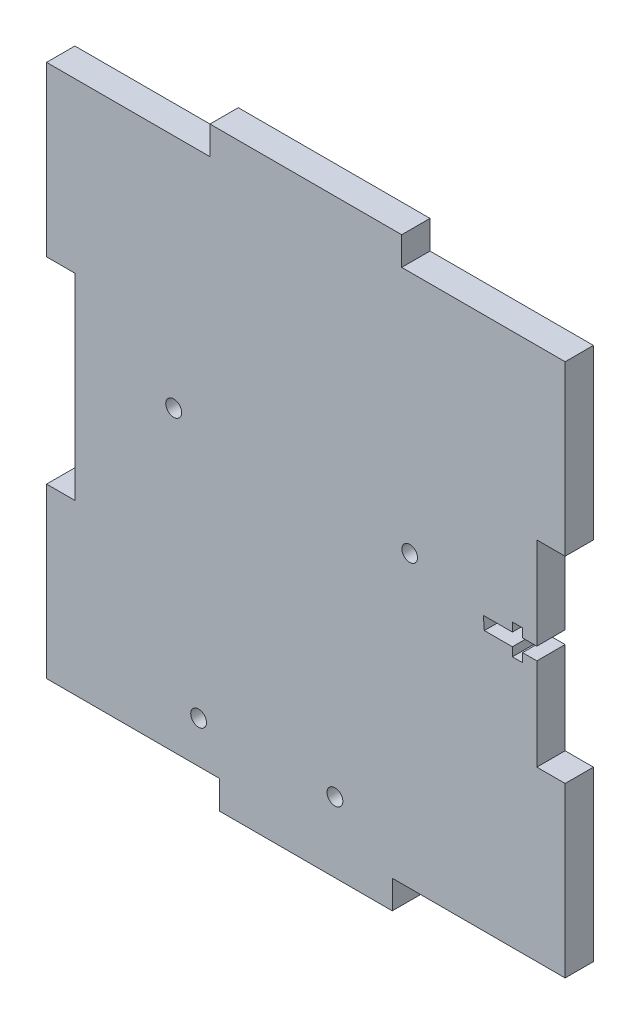
ISO-10303-21;
HEADER;
FILE_DESCRIPTION(('STEP AP214'),'2;1');
FILE_NAME('part.step','',(''),(''),'','','');
FILE_SCHEMA(('AUTOMOTIVE_DESIGN { 1 0 10303 214 1 1 1 1 }'));
ENDSEC;
DATA;
#1=APPLICATION_CONTEXT('core data for automotive mechanical design processes');
#2=APPLICATION_PROTOCOL_DEFINITION('international standard','automotive_design',2000,#1);
#3=PRODUCT_CONTEXT('',#1,'mechanical');
#4=PRODUCT('Part','Part','',(#3));
#5=PRODUCT_RELATED_PRODUCT_CATEGORY('part','',(#4));
#6=PRODUCT_DEFINITION_FORMATION('','',#4);
#7=PRODUCT_DEFINITION_CONTEXT('part definition',#1,'design');
#8=PRODUCT_DEFINITION('design','',#6,#7);
#9=PRODUCT_DEFINITION_SHAPE('','',#8);
#10=(LENGTH_UNIT() NAMED_UNIT(*) SI_UNIT(.MILLI.,.METRE.));
#11=(NAMED_UNIT(*) PLANE_ANGLE_UNIT() SI_UNIT($,.RADIAN.));
#12=(NAMED_UNIT(*) SI_UNIT($,.STERADIAN.) SOLID_ANGLE_UNIT());
#13=UNCERTAINTY_MEASURE_WITH_UNIT(LENGTH_MEASURE(1.E-05),#10,'distance_accuracy_value','');
#14=(GEOMETRIC_REPRESENTATION_CONTEXT(3) GLOBAL_UNCERTAINTY_ASSIGNED_CONTEXT((#13)) GLOBAL_UNIT_ASSIGNED_CONTEXT((#10,
#11,#12)) REPRESENTATION_CONTEXT('',''));
#15=CARTESIAN_POINT('',(0.,0.,0.));
#16=DIRECTION('',(0.,0.,1.));
#17=DIRECTION('',(1.,0.,0.));
#18=AXIS2_PLACEMENT_3D('',#15,#16,#17);
#19=CARTESIAN_POINT('',(-53.0606,-60.4012,5.7912));
#20=DIRECTION('',(1.,0.,0.));
#21=DIRECTION('',(0.,0.,-1.));
#22=AXIS2_PLACEMENT_3D('',#19,#20,#21);
#23=PLANE('',#22);
#24=DIRECTION('',(0.,-1.,0.));
#25=VECTOR('',#24,1.);
#26=CARTESIAN_POINT('',(-53.0606,-60.4012,5.7912));
#27=LINE('',#26,#25);
#28=CARTESIAN_POINT('',(-53.0606,-20.1337333333333,5.79120000000005));
#29=VERTEX_POINT('',#28);
#30=CARTESIAN_POINT('',(-53.0605999999982,-54.61,5.7912));
#31=VERTEX_POINT('',#30);
#32=EDGE_CURVE('E269',#29,#31,#27,.T.);
#33=ORIENTED_EDGE('',*,*,#32,.F.);
#34=DIRECTION('',(0.,0.,-1.));
#35=VECTOR('',#34,1.);
#36=CARTESIAN_POINT('',(-53.0606,-20.1337333333333,5.79120000000005));
#37=LINE('',#36,#35);
#38=CARTESIAN_POINT('',(-53.0606,-20.1337333333333,0.));
#39=VERTEX_POINT('',#38);
#40=EDGE_CURVE('E519',#29,#39,#37,.T.);
#41=ORIENTED_EDGE('',*,*,#40,.T.);
#42=DIRECTION('',(0.,-1.,0.));
#43=VECTOR('',#42,1.);
#44=CARTESIAN_POINT('',(-53.0606,-60.4012,0.));
#45=LINE('',#44,#43);
#46=CARTESIAN_POINT('',(-53.0605999999982,-54.61,0.));
#47=VERTEX_POINT('',#46);
#48=EDGE_CURVE('E285',#39,#47,#45,.T.);
#49=ORIENTED_EDGE('',*,*,#48,.T.);
#50=DIRECTION('',(0.,0.,1.));
#51=VECTOR('',#50,1.);
#52=CARTESIAN_POINT('',(-53.0605999999982,-54.61,0.));
#53=LINE('',#52,#51);
#54=EDGE_CURVE('E398',#47,#31,#53,.T.);
#55=ORIENTED_EDGE('',*,*,#54,.T.);
#56=EDGE_LOOP('',(#33,#41,#49,#55));
#57=FACE_BOUND('',#56,.T.);
#58=ADVANCED_FACE('F35',(#57),#23,.F.);
#59=CARTESIAN_POINT('',(53.0606,-60.4012,5.7912));
#60=DIRECTION('',(-1.,0.,0.));
#61=DIRECTION('',(0.,0.,1.));
#62=AXIS2_PLACEMENT_3D('',#59,#60,#61);
#63=PLANE('',#62);
#64=DIRECTION('',(0.,1.,0.));
#65=VECTOR('',#64,1.);
#66=CARTESIAN_POINT('',(53.0606,-60.4012,5.7912));
#67=LINE('',#66,#65);
#68=CARTESIAN_POINT('',(53.0606,20.1337333333333,5.79120000000005));
#69=VERTEX_POINT('',#68);
#70=CARTESIAN_POINT('',(53.0606,54.61,5.79120000000005));
#71=VERTEX_POINT('',#70);
#72=EDGE_CURVE('E290',#69,#71,#67,.T.);
#73=ORIENTED_EDGE('',*,*,#72,.F.);
#74=DIRECTION('',(0.,0.,-1.));
#75=VECTOR('',#74,1.);
#76=CARTESIAN_POINT('',(53.0606,20.1337333333333,5.79120000000005));
#77=LINE('',#76,#75);
#78=CARTESIAN_POINT('',(53.0606,20.1337333333333,0.));
#79=VERTEX_POINT('',#78);
#80=EDGE_CURVE('E427',#69,#79,#77,.T.);
#81=ORIENTED_EDGE('',*,*,#80,.T.);
#82=DIRECTION('',(0.,1.,0.));
#83=VECTOR('',#82,1.);
#84=CARTESIAN_POINT('',(53.0606,-60.4012,0.));
#85=LINE('',#84,#83);
#86=CARTESIAN_POINT('',(53.0606,54.61,0.));
#87=VERTEX_POINT('',#86);
#88=EDGE_CURVE('E282',#79,#87,#85,.T.);
#89=ORIENTED_EDGE('',*,*,#88,.T.);
#90=DIRECTION('',(0.,0.,-1.));
#91=VECTOR('',#90,1.);
#92=CARTESIAN_POINT('',(53.0606,54.61,5.79120000000005));
#93=LINE('',#92,#91);
#94=EDGE_CURVE('E363',#71,#87,#93,.T.);
#95=ORIENTED_EDGE('',*,*,#94,.F.);
#96=EDGE_LOOP('',(#73,#81,#89,#95));
#97=FACE_BOUND('',#96,.T.);
#98=ADVANCED_FACE('F425',(#97),#63,.F.);
#99=CARTESIAN_POINT('',(42.2656,3.0861,5.79120000000005));
#100=DIRECTION('',(-1.,0.,0.));
#101=DIRECTION('',(0.,0.,1.));
#102=AXIS2_PLACEMENT_3D('',#99,#100,#101);
#103=PLANE('',#102);
#104=DIRECTION('',(0.,1.,0.));
#105=VECTOR('',#104,1.);
#106=CARTESIAN_POINT('',(42.2656,3.0861,5.79120000000005));
#107=LINE('',#106,#105);
#108=CARTESIAN_POINT('',(42.2656,1.29723700939415,5.79120000000005));
#109=VERTEX_POINT('',#108);
#110=CARTESIAN_POINT('',(42.2656,3.0861,5.79120000000005));
#111=VERTEX_POINT('',#110);
#112=EDGE_CURVE('E331',#109,#111,#107,.T.);
#113=ORIENTED_EDGE('',*,*,#112,.F.);
#114=DIRECTION('',(0.,0.,-1.));
#115=VECTOR('',#114,1.);
#116=CARTESIAN_POINT('',(42.2656,1.29723700939415,5.79120000000005));
#117=LINE('',#116,#115);
#118=CARTESIAN_POINT('',(42.2656,1.29723700939415,0.));
#119=VERTEX_POINT('',#118);
#120=EDGE_CURVE('E489',#109,#119,#117,.T.);
#121=ORIENTED_EDGE('',*,*,#120,.T.);
#122=DIRECTION('',(0.,1.,0.));
#123=VECTOR('',#122,1.);
#124=CARTESIAN_POINT('',(42.2656,3.0861,0.));
#125=LINE('',#124,#123);
#126=CARTESIAN_POINT('',(42.2656,3.0861,0.));
#127=VERTEX_POINT('',#126);
#128=EDGE_CURVE('E323',#119,#127,#125,.T.);
#129=ORIENTED_EDGE('',*,*,#128,.T.);
#130=DIRECTION('',(0.,0.,-1.));
#131=VECTOR('',#130,1.);
#132=CARTESIAN_POINT('',(42.2656,3.0861,5.79120000000005));
#133=LINE('',#132,#131);
#134=EDGE_CURVE('E314',#111,#127,#133,.T.);
#135=ORIENTED_EDGE('',*,*,#134,.F.);
#136=EDGE_LOOP('',(#113,#121,#129,#135));
#137=FACE_BOUND('',#136,.T.);
#138=ADVANCED_FACE('F499',(#137),#103,.F.);
#139=CARTESIAN_POINT('',(44.3484,3.0861,5.79120000000005));
#140=DIRECTION('',(1.,0.,0.));
#141=DIRECTION('',(0.,1.,0.));
#142=AXIS2_PLACEMENT_3D('',#139,#140,#141);
#143=PLANE('',#142);
#144=DIRECTION('',(0.,-1.,0.));
#145=VECTOR('',#144,1.);
#146=CARTESIAN_POINT('',(44.3484,3.0861,0.));
#147=LINE('',#146,#145);
#148=CARTESIAN_POINT('',(44.3484,3.0861,0.));
#149=VERTEX_POINT('',#148);
#150=CARTESIAN_POINT('',(44.3484,1.29843851988012,0.));
#151=VERTEX_POINT('',#150);
#152=EDGE_CURVE('E300',#149,#151,#147,.T.);
#153=ORIENTED_EDGE('',*,*,#152,.T.);
#154=DIRECTION('',(0.,0.,1.));
#155=VECTOR('',#154,1.);
#156=CARTESIAN_POINT('',(44.3484,1.29843851988012,5.79120000000005));
#157=LINE('',#156,#155);
#158=CARTESIAN_POINT('',(44.3484,1.29843851988012,5.79120000000005));
#159=VERTEX_POINT('',#158);
#160=EDGE_CURVE('E43',#151,#159,#157,.T.);
#161=ORIENTED_EDGE('',*,*,#160,.T.);
#162=DIRECTION('',(0.,-1.,0.));
#163=VECTOR('',#162,1.);
#164=CARTESIAN_POINT('',(44.3484,3.0861,5.79120000000005));
#165=LINE('',#164,#163);
#166=CARTESIAN_POINT('',(44.3484,3.0861,5.7912));
#167=VERTEX_POINT('',#166);
#168=EDGE_CURVE('E297',#167,#159,#165,.T.);
#169=ORIENTED_EDGE('',*,*,#168,.F.);
#170=DIRECTION('',(0.,0.,-1.));
#171=VECTOR('',#170,1.);
#172=CARTESIAN_POINT('',(44.3484,3.0861,5.79120000000005));
#173=LINE('',#172,#171);
#174=EDGE_CURVE('E338',#167,#149,#173,.T.);
#175=ORIENTED_EDGE('',*,*,#174,.T.);
#176=EDGE_LOOP('',(#153,#161,#169,#175));
#177=FACE_BOUND('',#176,.T.);
#178=ADVANCED_FACE('F296',(#177),#143,.F.);
#179=CARTESIAN_POINT('',(53.0606000000018,-54.6099999999999,0.));
#180=VERTEX_POINT('',#179);
#181=CARTESIAN_POINT('',(53.0606,-20.1337333333333,0.));
#182=VERTEX_POINT('',#181);
#183=EDGE_CURVE('E278',#180,#182,#85,.T.);
#184=ORIENTED_EDGE('',*,*,#183,.T.);
#185=DIRECTION('',(0.,0.,-1.));
#186=VECTOR('',#185,1.);
#187=CARTESIAN_POINT('',(53.0606,-20.1337333333333,5.79120000000005));
#188=LINE('',#187,#186);
#189=CARTESIAN_POINT('',(53.0606,-20.1337333333333,5.79120000000005));
#190=VERTEX_POINT('',#189);
#191=EDGE_CURVE('E450',#190,#182,#188,.T.);
#192=ORIENTED_EDGE('',*,*,#191,.F.);
#193=CARTESIAN_POINT('',(53.0606000000018,-54.6099999999999,5.79120000000005));
#194=VERTEX_POINT('',#193);
#195=EDGE_CURVE('E407',#194,#190,#67,.T.);
#196=ORIENTED_EDGE('',*,*,#195,.F.);
#197=DIRECTION('',(0.,0.,-1.));
#198=VECTOR('',#197,1.);
#199=CARTESIAN_POINT('',(53.0606000000018,-54.6099999999998,166.5224));
#200=LINE('',#199,#198);
#201=EDGE_CURVE('E401',#194,#180,#200,.T.);
#202=ORIENTED_EDGE('',*,*,#201,.T.);
#203=EDGE_LOOP('',(#184,#192,#196,#202));
#204=FACE_BOUND('',#203,.T.);
#205=ADVANCED_FACE('F37',(#204),#63,.F.);
#206=CARTESIAN_POINT('',(-53.0606,54.61,0.));
#207=VERTEX_POINT('',#206);
#208=CARTESIAN_POINT('',(-53.0606,20.1337333333333,0.));
#209=VERTEX_POINT('',#208);
#210=EDGE_CURVE('E260',#207,#209,#45,.T.);
#211=ORIENTED_EDGE('',*,*,#210,.T.);
#212=DIRECTION('',(0.,0.,-1.));
#213=VECTOR('',#212,1.);
#214=CARTESIAN_POINT('',(-53.0606,20.1337333333333,5.79120000000005));
#215=LINE('',#214,#213);
#216=CARTESIAN_POINT('',(-53.0606,20.1337333333333,5.79120000000005));
#217=VERTEX_POINT('',#216);
#218=EDGE_CURVE('E50',#217,#209,#215,.T.);
#219=ORIENTED_EDGE('',*,*,#218,.F.);
#220=CARTESIAN_POINT('',(-53.0606,54.61,5.79120000000005));
#221=VERTEX_POINT('',#220);
#222=EDGE_CURVE('E258',#221,#217,#27,.T.);
#223=ORIENTED_EDGE('',*,*,#222,.F.);
#224=DIRECTION('',(0.,0.,-1.));
#225=VECTOR('',#224,1.);
#226=CARTESIAN_POINT('',(-53.0606,54.61,5.79120000000005));
#227=LINE('',#226,#225);
#228=EDGE_CURVE('E350',#221,#207,#227,.T.);
#229=ORIENTED_EDGE('',*,*,#228,.T.);
#230=EDGE_LOOP('',(#211,#219,#223,#229));
#231=FACE_BOUND('',#230,.T.);
#232=ADVANCED_FACE('F256',(#231),#23,.F.);
#233=CARTESIAN_POINT('',(-53.0606,-60.4012,5.7912));
#234=DIRECTION('',(0.,1.,0.));
#235=DIRECTION('',(0.,0.,1.));
#236=AXIS2_PLACEMENT_3D('',#233,#234,#235);
#237=PLANE('',#236);
#238=DIRECTION('',(0.,0.,-1.));
#239=VECTOR('',#238,1.);
#240=CARTESIAN_POINT('',(17.6868666666685,-60.4011999999999,0.));
#241=LINE('',#240,#239);
#242=CARTESIAN_POINT('',(17.6868666666685,-60.4011999999999,5.79119999999993));
#243=VERTEX_POINT('',#242);
#244=CARTESIAN_POINT('',(17.6868666666685,-60.4012,0.));
#245=VERTEX_POINT('',#244);
#246=EDGE_CURVE('E375',#243,#245,#241,.T.);
#247=ORIENTED_EDGE('',*,*,#246,.F.);
#248=DIRECTION('',(1.,0.,0.));
#249=VECTOR('',#248,1.);
#250=CARTESIAN_POINT('',(-53.0606,-60.4012,5.7912));
#251=LINE('',#250,#249);
#252=CARTESIAN_POINT('',(-17.6868666666649,-60.4011999999999,5.79119999999994));
#253=VERTEX_POINT('',#252);
#254=EDGE_CURVE('E268',#253,#243,#251,.T.);
#255=ORIENTED_EDGE('',*,*,#254,.F.);
#256=DIRECTION('',(0.,0.,1.));
#257=VECTOR('',#256,1.);
#258=CARTESIAN_POINT('',(-17.6868666666649,-60.4011999999999,0.));
#259=LINE('',#258,#257);
#260=CARTESIAN_POINT('',(-17.6868666666649,-60.4011999999999,0.));
#261=VERTEX_POINT('',#260);
#262=EDGE_CURVE('E377',#261,#253,#259,.T.);
#263=ORIENTED_EDGE('',*,*,#262,.F.);
#264=DIRECTION('',(1.,0.,0.));
#265=VECTOR('',#264,1.);
#266=CARTESIAN_POINT('',(-53.0606,-60.4012,0.));
#267=LINE('',#266,#265);
#268=EDGE_CURVE('E287',#261,#245,#267,.T.);
#269=ORIENTED_EDGE('',*,*,#268,.T.);
#270=EDGE_LOOP('',(#247,#255,#263,#269));
#271=FACE_BOUND('',#270,.T.);
#272=ADVANCED_FACE('F442',(#271),#237,.F.);
#273=CARTESIAN_POINT('',(0.,0.,5.7912));
#274=DIRECTION('',(0.,0.,-1.));
#275=DIRECTION('',(-1.,0.,0.));
#276=AXIS2_PLACEMENT_3D('',#273,#274,#275);
#277=PLANE('',#276);
#278=CARTESIAN_POINT('',(21.254400000001,4.74000000000046,5.7912));
#279=DIRECTION('',(0.,0.,1.));
#280=DIRECTION('',(1.,0.,0.));
#281=AXIS2_PLACEMENT_3D('',#278,#279,#280);
#282=CIRCLE('',#281,1.59999999999999);
#283=CARTESIAN_POINT('',(22.854400000001,4.74000000000046,5.7912));
#284=VERTEX_POINT('',#283);
#285=EDGE_CURVE('E710',#284,#284,#282,.T.);
#286=ORIENTED_EDGE('',*,*,#285,.F.);
#287=EDGE_LOOP('',(#286));
#288=FACE_BOUND('',#287,.T.);
#289=CARTESIAN_POINT('',(-21.9455999999989,-46.0599999999996,5.7912));
#290=DIRECTION('',(0.,0.,1.));
#291=DIRECTION('',(1.,0.,0.));
#292=AXIS2_PLACEMENT_3D('',#289,#290,#291);
#293=CIRCLE('',#292,1.61295728551822);
#294=CARTESIAN_POINT('',(-20.3326427144807,-46.0599999999996,5.7912));
#295=VERTEX_POINT('',#294);
#296=EDGE_CURVE('E705',#295,#295,#293,.T.);
#297=ORIENTED_EDGE('',*,*,#296,.F.);
#298=EDGE_LOOP('',(#297));
#299=FACE_BOUND('',#298,.T.);
#300=CARTESIAN_POINT('',(-27.0455999999989,6.34000000000041,5.7912));
#301=DIRECTION('',(0.,0.,1.));
#302=DIRECTION('',(1.,0.,0.));
#303=AXIS2_PLACEMENT_3D('',#300,#301,#302);
#304=CIRCLE('',#303,1.62888144865758);
#305=CARTESIAN_POINT('',(-25.4167185513414,6.34000000000041,5.7912));
#306=VERTEX_POINT('',#305);
#307=EDGE_CURVE('E641',#306,#306,#304,.T.);
#308=ORIENTED_EDGE('',*,*,#307,.F.);
#309=EDGE_LOOP('',(#308));
#310=FACE_BOUND('',#309,.T.);
#311=CARTESIAN_POINT('',(5.95440000000109,-46.0599999999995,5.7912));
#312=DIRECTION('',(0.,0.,1.));
#313=DIRECTION('',(1.,0.,0.));
#314=AXIS2_PLACEMENT_3D('',#311,#312,#313);
#315=CIRCLE('',#314,1.61582846667146);
#316=CARTESIAN_POINT('',(7.57022846667256,-46.0599999999995,5.7912));
#317=VERTEX_POINT('',#316);
#318=EDGE_CURVE('E634',#317,#317,#315,.T.);
#319=ORIENTED_EDGE('',*,*,#318,.F.);
#320=EDGE_LOOP('',(#319));
#321=FACE_BOUND('',#320,.T.);
#322=DIRECTION('',(0.,-1.,0.));
#323=VECTOR('',#322,1.);
#324=CARTESIAN_POINT('',(-47.2694,-20.1337333333333,5.79120000000005));
#325=LINE('',#324,#323);
#326=CARTESIAN_POINT('',(-47.2694,20.1337333333333,5.79120000000005));
#327=VERTEX_POINT('',#326);
#328=CARTESIAN_POINT('',(-47.2694,-20.1337333333333,5.79120000000005));
#329=VERTEX_POINT('',#328);
#330=EDGE_CURVE('E250',#327,#329,#325,.T.);
#331=ORIENTED_EDGE('',*,*,#330,.T.);
#332=DIRECTION('',(-1.,0.,0.));
#333=VECTOR('',#332,1.);
#334=CARTESIAN_POINT('',(-53.0606,-20.1337333333333,5.79120000000005));
#335=LINE('',#334,#333);
#336=EDGE_CURVE('E261',#329,#29,#335,.T.);
#337=ORIENTED_EDGE('',*,*,#336,.T.);
#338=ORIENTED_EDGE('',*,*,#32,.T.);
#339=DIRECTION('',(-1.,0.,0.));
#340=VECTOR('',#339,1.);
#341=CARTESIAN_POINT('',(0.,-54.6099999999999,5.7912));
#342=LINE('',#341,#340);
#343=CARTESIAN_POINT('',(-17.6868666666649,-54.6099999999999,5.79119999999994));
#344=VERTEX_POINT('',#343);
#345=EDGE_CURVE('E404',#344,#31,#342,.T.);
#346=ORIENTED_EDGE('',*,*,#345,.F.);
#347=DIRECTION('',(0.,1.,0.));
#348=VECTOR('',#347,1.);
#349=CARTESIAN_POINT('',(-17.6868666666649,-60.4011999999999,5.79119999999994));
#350=LINE('',#349,#348);
#351=EDGE_CURVE('E388',#253,#344,#350,.T.);
#352=ORIENTED_EDGE('',*,*,#351,.F.);
#353=ORIENTED_EDGE('',*,*,#254,.T.);
#354=DIRECTION('',(0.,1.,0.));
#355=VECTOR('',#354,1.);
#356=CARTESIAN_POINT('',(17.6868666666685,-60.4011999999999,5.79119999999993));
#357=LINE('',#356,#355);
#358=CARTESIAN_POINT('',(17.6868666666684,-54.6099999999999,5.79119999999993));
#359=VERTEX_POINT('',#358);
#360=EDGE_CURVE('E384',#243,#359,#357,.T.);
#361=ORIENTED_EDGE('',*,*,#360,.T.);
#362=EDGE_CURVE('E406',#194,#359,#342,.T.);
#363=ORIENTED_EDGE('',*,*,#362,.F.);
#364=ORIENTED_EDGE('',*,*,#195,.T.);
#365=DIRECTION('',(-1.,0.,0.));
#366=VECTOR('',#365,1.);
#367=CARTESIAN_POINT('',(53.0606,-20.1337333333333,5.79120000000005));
#368=LINE('',#367,#366);
#369=CARTESIAN_POINT('',(47.2694,-20.1337333333333,5.79120000000005));
#370=VERTEX_POINT('',#369);
#371=EDGE_CURVE('E511',#190,#370,#368,.T.);
#372=ORIENTED_EDGE('',*,*,#371,.T.);
#373=DIRECTION('',(0.,1.,0.));
#374=VECTOR('',#373,1.);
#375=CARTESIAN_POINT('',(47.2694,-20.1337333333333,5.79120000000005));
#376=LINE('',#375,#374);
#377=CARTESIAN_POINT('',(47.2694,-1.30175,5.79120000000005));
#378=VERTEX_POINT('',#377);
#379=EDGE_CURVE('E457',#370,#378,#376,.T.);
#380=ORIENTED_EDGE('',*,*,#379,.T.);
#381=DIRECTION('',(-1.,0.,0.));
#382=VECTOR('',#381,1.);
#383=CARTESIAN_POINT('',(50.0888,-1.30175,5.79120000000005));
#384=LINE('',#383,#382);
#385=CARTESIAN_POINT('',(44.3484,-1.30175000000001,5.79120000000005));
#386=VERTEX_POINT('',#385);
#387=EDGE_CURVE('E468',#378,#386,#384,.T.);
#388=ORIENTED_EDGE('',*,*,#387,.T.);
#389=CARTESIAN_POINT('',(44.3484,-3.0861,5.79120000000005));
#390=VERTEX_POINT('',#389);
#391=EDGE_CURVE('E311',#386,#390,#165,.T.);
#392=ORIENTED_EDGE('',*,*,#391,.T.);
#393=DIRECTION('',(-1.,0.,0.));
#394=VECTOR('',#393,1.);
#395=CARTESIAN_POINT('',(42.2656,-3.0861,5.79120000000005));
#396=LINE('',#395,#394);
#397=CARTESIAN_POINT('',(42.2656,-3.0861,5.79120000000005));
#398=VERTEX_POINT('',#397);
#399=EDGE_CURVE('E310',#390,#398,#396,.T.);
#400=ORIENTED_EDGE('',*,*,#399,.T.);
#401=CARTESIAN_POINT('',(42.2656,-1.30175000000002,5.79120000000005));
#402=VERTEX_POINT('',#401);
#403=EDGE_CURVE('E491',#398,#402,#107,.T.);
#404=ORIENTED_EDGE('',*,*,#403,.T.);
#405=CARTESIAN_POINT('',(36.5252,-1.30175000000002,5.79120000000005));
#406=VERTEX_POINT('',#405);
#407=EDGE_CURVE('E467',#402,#406,#384,.T.);
#408=ORIENTED_EDGE('',*,*,#407,.T.);
#409=DIRECTION('',(-0.0780479006445477,0.996949610163412,0.));
#410=VECTOR('',#409,1.);
#411=CARTESIAN_POINT('',(36.3220022906719,1.29380831006048,5.79120000000005));
#412=LINE('',#411,#410);
#413=CARTESIAN_POINT('',(36.3220022906719,1.29380831006048,5.79120000000005));
#414=VERTEX_POINT('',#413);
#415=EDGE_CURVE('E470',#406,#414,#412,.T.);
#416=ORIENTED_EDGE('',*,*,#415,.T.);
#417=DIRECTION('',(0.999999833608978,0.000576872616695067,0.));
#418=VECTOR('',#417,1.);
#419=CARTESIAN_POINT('',(50.0888,1.30175,5.79120000000005));
#420=LINE('',#419,#418);
#421=EDGE_CURVE('E464',#414,#109,#420,.T.);
#422=ORIENTED_EDGE('',*,*,#421,.T.);
#423=ORIENTED_EDGE('',*,*,#112,.T.);
#424=DIRECTION('',(1.,0.,0.));
#425=VECTOR('',#424,1.);
#426=CARTESIAN_POINT('',(42.2656,3.0861,5.79120000000005));
#427=LINE('',#426,#425);
#428=EDGE_CURVE('E309',#111,#167,#427,.T.);
#429=ORIENTED_EDGE('',*,*,#428,.T.);
#430=ORIENTED_EDGE('',*,*,#168,.T.);
#431=CARTESIAN_POINT('',(47.2694,1.30012356507387,5.79120000000005));
#432=VERTEX_POINT('',#431);
#433=EDGE_CURVE('E307',#159,#432,#420,.T.);
#434=ORIENTED_EDGE('',*,*,#433,.T.);
#435=CARTESIAN_POINT('',(47.2694,20.1337333333333,5.79120000000005));
#436=VERTEX_POINT('',#435);
#437=EDGE_CURVE('E510',#432,#436,#376,.T.);
#438=ORIENTED_EDGE('',*,*,#437,.T.);
#439=DIRECTION('',(1.,0.,0.));
#440=VECTOR('',#439,1.);
#441=CARTESIAN_POINT('',(53.0606,20.1337333333333,5.79120000000005));
#442=LINE('',#441,#440);
#443=EDGE_CURVE('E417',#436,#69,#442,.T.);
#444=ORIENTED_EDGE('',*,*,#443,.T.);
#445=ORIENTED_EDGE('',*,*,#72,.T.);
#446=DIRECTION('',(-1.,0.,0.));
#447=VECTOR('',#446,1.);
#448=CARTESIAN_POINT('',(53.0606,54.61,5.79120000000005));
#449=LINE('',#448,#447);
#450=CARTESIAN_POINT('',(19.6172666666667,54.61,5.79120000000005));
#451=VERTEX_POINT('',#450);
#452=EDGE_CURVE('E356',#71,#451,#449,.T.);
#453=ORIENTED_EDGE('',*,*,#452,.T.);
#454=DIRECTION('',(0.,1.,0.));
#455=VECTOR('',#454,1.);
#456=CARTESIAN_POINT('',(19.6172666666667,60.4012,5.79120000000005));
#457=LINE('',#456,#455);
#458=CARTESIAN_POINT('',(19.6172666666667,60.4012,5.79120000000005));
#459=VERTEX_POINT('',#458);
#460=EDGE_CURVE('E359',#451,#459,#457,.T.);
#461=ORIENTED_EDGE('',*,*,#460,.T.);
#462=DIRECTION('',(-1.,0.,0.));
#463=VECTOR('',#462,1.);
#464=CARTESIAN_POINT('',(-53.0606,60.4012,5.7912));
#465=LINE('',#464,#463);
#466=CARTESIAN_POINT('',(-19.6172666666667,60.4012,5.7912));
#467=VERTEX_POINT('',#466);
#468=EDGE_CURVE('E274',#459,#467,#465,.T.);
#469=ORIENTED_EDGE('',*,*,#468,.T.);
#470=DIRECTION('',(0.,-1.,0.));
#471=VECTOR('',#470,1.);
#472=CARTESIAN_POINT('',(-19.6172666666667,60.4012,5.79120000000005));
#473=LINE('',#472,#471);
#474=CARTESIAN_POINT('',(-19.6172666666667,54.61,5.79120000000005));
#475=VERTEX_POINT('',#474);
#476=EDGE_CURVE('E342',#467,#475,#473,.T.);
#477=ORIENTED_EDGE('',*,*,#476,.T.);
#478=DIRECTION('',(-1.,0.,0.));
#479=VECTOR('',#478,1.);
#480=CARTESIAN_POINT('',(-53.0606,54.61,5.79120000000005));
#481=LINE('',#480,#479);
#482=EDGE_CURVE('E267',#475,#221,#481,.T.);
#483=ORIENTED_EDGE('',*,*,#482,.T.);
#484=ORIENTED_EDGE('',*,*,#222,.T.);
#485=DIRECTION('',(1.,0.,0.));
#486=VECTOR('',#485,1.);
#487=CARTESIAN_POINT('',(-53.0606,20.1337333333333,5.79120000000005));
#488=LINE('',#487,#486);
#489=EDGE_CURVE('E243',#217,#327,#488,.T.);
#490=ORIENTED_EDGE('',*,*,#489,.T.);
#491=EDGE_LOOP('',(#331,#337,#338,#346,#352,#353,#361,#363,#364,#372,#380,#388,#392,#400,#404,
#408,#416,#422,#423,#429,#430,#434,#438,#444,#445,#453,#461,#469,#477,#483,#484,#490));
#492=FACE_BOUND('',#491,.T.);
#493=ADVANCED_FACE('F264',(#288,#299,#310,#321,#492),#277,.F.);
#494=CARTESIAN_POINT('',(0.,0.,0.));
#495=DIRECTION('',(0.,0.,-1.));
#496=DIRECTION('',(-1.,0.,0.));
#497=AXIS2_PLACEMENT_3D('',#494,#495,#496);
#498=PLANE('',#497);
#499=CARTESIAN_POINT('',(21.254400000001,4.74000000000046,0.));
#500=DIRECTION('',(0.,0.,1.));
#501=DIRECTION('',(1.,0.,0.));
#502=AXIS2_PLACEMENT_3D('',#499,#500,#501);
#503=CIRCLE('',#502,1.59999999999999);
#504=CARTESIAN_POINT('',(22.854400000001,4.74000000000046,0.));
#505=VERTEX_POINT('',#504);
#506=EDGE_CURVE('E694',#505,#505,#503,.T.);
#507=ORIENTED_EDGE('',*,*,#506,.T.);
#508=EDGE_LOOP('',(#507));
#509=FACE_BOUND('',#508,.T.);
#510=CARTESIAN_POINT('',(-21.9455999999989,-46.0599999999996,0.));
#511=DIRECTION('',(0.,0.,1.));
#512=DIRECTION('',(1.,0.,0.));
#513=AXIS2_PLACEMENT_3D('',#510,#511,#512);
#514=CIRCLE('',#513,1.61295728551822);
#515=CARTESIAN_POINT('',(-20.3326427144807,-46.0599999999996,0.));
#516=VERTEX_POINT('',#515);
#517=EDGE_CURVE('E698',#516,#516,#514,.T.);
#518=ORIENTED_EDGE('',*,*,#517,.T.);
#519=EDGE_LOOP('',(#518));
#520=FACE_BOUND('',#519,.T.);
#521=CARTESIAN_POINT('',(-27.0455999999989,6.34000000000041,0.));
#522=DIRECTION('',(0.,0.,1.));
#523=DIRECTION('',(1.,0.,0.));
#524=AXIS2_PLACEMENT_3D('',#521,#522,#523);
#525=CIRCLE('',#524,1.62888144865758);
#526=CARTESIAN_POINT('',(-25.4167185513414,6.34000000000041,0.));
#527=VERTEX_POINT('',#526);
#528=EDGE_CURVE('E636',#527,#527,#525,.T.);
#529=ORIENTED_EDGE('',*,*,#528,.T.);
#530=EDGE_LOOP('',(#529));
#531=FACE_BOUND('',#530,.T.);
#532=CARTESIAN_POINT('',(5.95440000000109,-46.0599999999995,0.));
#533=DIRECTION('',(0.,0.,1.));
#534=DIRECTION('',(1.,0.,0.));
#535=AXIS2_PLACEMENT_3D('',#532,#533,#534);
#536=CIRCLE('',#535,1.61582846667146);
#537=CARTESIAN_POINT('',(7.57022846667256,-46.0599999999995,0.));
#538=VERTEX_POINT('',#537);
#539=EDGE_CURVE('E631',#538,#538,#536,.T.);
#540=ORIENTED_EDGE('',*,*,#539,.T.);
#541=EDGE_LOOP('',(#540));
#542=FACE_BOUND('',#541,.T.);
#543=DIRECTION('',(-1.,0.,0.));
#544=VECTOR('',#543,1.);
#545=CARTESIAN_POINT('',(-53.0606,-20.1337333333333,0.));
#546=LINE('',#545,#544);
#547=CARTESIAN_POINT('',(-47.2694,-20.1337333333333,0.));
#548=VERTEX_POINT('',#547);
#549=EDGE_CURVE('E251',#548,#39,#546,.T.);
#550=ORIENTED_EDGE('',*,*,#549,.F.);
#551=DIRECTION('',(0.,-1.,0.));
#552=VECTOR('',#551,1.);
#553=CARTESIAN_POINT('',(-47.2694,-20.1337333333333,0.));
#554=LINE('',#553,#552);
#555=CARTESIAN_POINT('',(-47.2694,20.1337333333333,0.));
#556=VERTEX_POINT('',#555);
#557=EDGE_CURVE('E649',#556,#548,#554,.T.);
#558=ORIENTED_EDGE('',*,*,#557,.F.);
#559=DIRECTION('',(1.,0.,0.));
#560=VECTOR('',#559,1.);
#561=CARTESIAN_POINT('',(-53.0606,20.1337333333333,0.));
#562=LINE('',#561,#560);
#563=EDGE_CURVE('E638',#209,#556,#562,.T.);
#564=ORIENTED_EDGE('',*,*,#563,.F.);
#565=ORIENTED_EDGE('',*,*,#210,.F.);
#566=DIRECTION('',(-1.,0.,0.));
#567=VECTOR('',#566,1.);
#568=CARTESIAN_POINT('',(-53.0606,54.61,0.));
#569=LINE('',#568,#567);
#570=CARTESIAN_POINT('',(-19.6172666666667,54.61,0.));
#571=VERTEX_POINT('',#570);
#572=EDGE_CURVE('E344',#571,#207,#569,.T.);
#573=ORIENTED_EDGE('',*,*,#572,.F.);
#574=DIRECTION('',(0.,-1.,0.));
#575=VECTOR('',#574,1.);
#576=CARTESIAN_POINT('',(-19.6172666666667,60.4012,0.));
#577=LINE('',#576,#575);
#578=CARTESIAN_POINT('',(-19.6172666666667,60.4012,0.));
#579=VERTEX_POINT('',#578);
#580=EDGE_CURVE('E334',#579,#571,#577,.T.);
#581=ORIENTED_EDGE('',*,*,#580,.F.);
#582=DIRECTION('',(-1.,0.,0.));
#583=VECTOR('',#582,1.);
#584=CARTESIAN_POINT('',(-53.0606,60.4012,0.));
#585=LINE('',#584,#583);
#586=CARTESIAN_POINT('',(19.6172666666667,60.4012,0.));
#587=VERTEX_POINT('',#586);
#588=EDGE_CURVE('E281',#587,#579,#585,.T.);
#589=ORIENTED_EDGE('',*,*,#588,.F.);
#590=DIRECTION('',(0.,1.,0.));
#591=VECTOR('',#590,1.);
#592=CARTESIAN_POINT('',(19.6172666666667,60.4012,0.));
#593=LINE('',#592,#591);
#594=CARTESIAN_POINT('',(19.6172666666667,54.61,0.));
#595=VERTEX_POINT('',#594);
#596=EDGE_CURVE('E360',#595,#587,#593,.T.);
#597=ORIENTED_EDGE('',*,*,#596,.F.);
#598=DIRECTION('',(-1.,0.,0.));
#599=VECTOR('',#598,1.);
#600=CARTESIAN_POINT('',(53.0606,54.61,0.));
#601=LINE('',#600,#599);
#602=EDGE_CURVE('E352',#87,#595,#601,.T.);
#603=ORIENTED_EDGE('',*,*,#602,.F.);
#604=ORIENTED_EDGE('',*,*,#88,.F.);
#605=DIRECTION('',(1.,0.,0.));
#606=VECTOR('',#605,1.);
#607=CARTESIAN_POINT('',(53.0606,20.1337333333333,0.));
#608=LINE('',#607,#606);
#609=CARTESIAN_POINT('',(47.2694,20.1337333333333,0.));
#610=VERTEX_POINT('',#609);
#611=EDGE_CURVE('E514',#610,#79,#608,.T.);
#612=ORIENTED_EDGE('',*,*,#611,.F.);
#613=DIRECTION('',(0.,1.,0.));
#614=VECTOR('',#613,1.);
#615=CARTESIAN_POINT('',(47.2694,-20.1337333333333,0.));
#616=LINE('',#615,#614);
#617=CARTESIAN_POINT('',(47.2694,1.30012356507387,0.));
#618=VERTEX_POINT('',#617);
#619=EDGE_CURVE('E505',#618,#610,#616,.T.);
#620=ORIENTED_EDGE('',*,*,#619,.F.);
#621=DIRECTION('',(0.999999833608978,0.000576872616695067,0.));
#622=VECTOR('',#621,1.);
#623=CARTESIAN_POINT('',(50.0888,1.30175,0.));
#624=LINE('',#623,#622);
#625=EDGE_CURVE('E463',#151,#618,#624,.T.);
#626=ORIENTED_EDGE('',*,*,#625,.F.);
#627=ORIENTED_EDGE('',*,*,#152,.F.);
#628=DIRECTION('',(1.,0.,0.));
#629=VECTOR('',#628,1.);
#630=CARTESIAN_POINT('',(42.2656,3.0861,0.));
#631=LINE('',#630,#629);
#632=EDGE_CURVE('E322',#127,#149,#631,.T.);
#633=ORIENTED_EDGE('',*,*,#632,.F.);
#634=ORIENTED_EDGE('',*,*,#128,.F.);
#635=CARTESIAN_POINT('',(36.3220022906719,1.29380831006048,0.));
#636=VERTEX_POINT('',#635);
#637=EDGE_CURVE('E474',#636,#119,#624,.T.);
#638=ORIENTED_EDGE('',*,*,#637,.F.);
#639=DIRECTION('',(-0.0780479006445477,0.996949610163412,0.));
#640=VECTOR('',#639,1.);
#641=CARTESIAN_POINT('',(36.3220022906719,1.29380831006048,0.));
#642=LINE('',#641,#640);
#643=CARTESIAN_POINT('',(36.5252,-1.30175000000002,0.));
#644=VERTEX_POINT('',#643);
#645=EDGE_CURVE('E479',#644,#636,#642,.T.);
#646=ORIENTED_EDGE('',*,*,#645,.F.);
#647=DIRECTION('',(-1.,0.,0.));
#648=VECTOR('',#647,1.);
#649=CARTESIAN_POINT('',(50.0888,-1.30175,0.));
#650=LINE('',#649,#648);
#651=CARTESIAN_POINT('',(42.2656,-1.30175000000001,0.));
#652=VERTEX_POINT('',#651);
#653=EDGE_CURVE('E476',#652,#644,#650,.T.);
#654=ORIENTED_EDGE('',*,*,#653,.F.);
#655=CARTESIAN_POINT('',(42.2656,-3.0861,0.));
#656=VERTEX_POINT('',#655);
#657=EDGE_CURVE('E319',#656,#652,#125,.T.);
#658=ORIENTED_EDGE('',*,*,#657,.F.);
#659=DIRECTION('',(-1.,0.,0.));
#660=VECTOR('',#659,1.);
#661=CARTESIAN_POINT('',(42.2656,-3.0861,0.));
#662=LINE('',#661,#660);
#663=CARTESIAN_POINT('',(44.3484,-3.0861,0.));
#664=VERTEX_POINT('',#663);
#665=EDGE_CURVE('E328',#664,#656,#662,.T.);
#666=ORIENTED_EDGE('',*,*,#665,.F.);
#667=CARTESIAN_POINT('',(44.3484,-1.30175000000002,0.));
#668=VERTEX_POINT('',#667);
#669=EDGE_CURVE('E326',#668,#664,#147,.T.);
#670=ORIENTED_EDGE('',*,*,#669,.F.);
#671=CARTESIAN_POINT('',(47.2694,-1.30175,0.));
#672=VERTEX_POINT('',#671);
#673=EDGE_CURVE('E477',#672,#668,#650,.T.);
#674=ORIENTED_EDGE('',*,*,#673,.F.);
#675=CARTESIAN_POINT('',(47.2694,-20.1337333333333,0.));
#676=VERTEX_POINT('',#675);
#677=EDGE_CURVE('E58',#676,#672,#616,.T.);
#678=ORIENTED_EDGE('',*,*,#677,.F.);
#679=DIRECTION('',(-1.,0.,0.));
#680=VECTOR('',#679,1.);
#681=CARTESIAN_POINT('',(53.0606,-20.1337333333333,0.));
#682=LINE('',#681,#680);
#683=EDGE_CURVE('E517',#182,#676,#682,.T.);
#684=ORIENTED_EDGE('',*,*,#683,.F.);
#685=ORIENTED_EDGE('',*,*,#183,.F.);
#686=DIRECTION('',(-1.,0.,0.));
#687=VECTOR('',#686,1.);
#688=CARTESIAN_POINT('',(53.0606000000018,-54.6099999999999,0.));
#689=LINE('',#688,#687);
#690=CARTESIAN_POINT('',(17.6868666666684,-54.6099999999999,0.));
#691=VERTEX_POINT('',#690);
#692=EDGE_CURVE('E395',#180,#691,#689,.T.);
#693=ORIENTED_EDGE('',*,*,#692,.T.);
#694=DIRECTION('',(0.,1.,0.));
#695=VECTOR('',#694,1.);
#696=CARTESIAN_POINT('',(17.6868666666685,-60.4011999999999,0.));
#697=LINE('',#696,#695);
#698=EDGE_CURVE('E380',#245,#691,#697,.T.);
#699=ORIENTED_EDGE('',*,*,#698,.F.);
#700=ORIENTED_EDGE('',*,*,#268,.F.);
#701=DIRECTION('',(0.,1.,0.));
#702=VECTOR('',#701,1.);
#703=CARTESIAN_POINT('',(-17.6868666666649,-60.4011999999999,0.));
#704=LINE('',#703,#702);
#705=CARTESIAN_POINT('',(-17.6868666666649,-54.6099999999999,0.));
#706=VERTEX_POINT('',#705);
#707=EDGE_CURVE('E390',#261,#706,#704,.T.);
#708=ORIENTED_EDGE('',*,*,#707,.T.);
#709=EDGE_CURVE('E387',#706,#47,#689,.T.);
#710=ORIENTED_EDGE('',*,*,#709,.T.);
#711=ORIENTED_EDGE('',*,*,#48,.F.);
#712=EDGE_LOOP('',(#550,#558,#564,#565,#573,#581,#589,#597,#603,#604,#612,#620,#626,#627,#633,
#634,#638,#646,#654,#658,#666,#670,#674,#678,#684,#685,#693,#699,#700,#708,#710,#711));
#713=FACE_BOUND('',#712,.T.);
#714=ADVANCED_FACE('F445',(#509,#520,#531,#542,#713),#498,.T.);
#715=CARTESIAN_POINT('',(-53.0606,60.4012,5.7912));
#716=DIRECTION('',(0.,-1.,0.));
#717=DIRECTION('',(0.,0.,-1.));
#718=AXIS2_PLACEMENT_3D('',#715,#716,#717);
#719=PLANE('',#718);
#720=ORIENTED_EDGE('',*,*,#588,.T.);
#721=DIRECTION('',(0.,0.,-1.));
#722=VECTOR('',#721,1.);
#723=CARTESIAN_POINT('',(-19.6172666666667,60.4012,5.79120000000005));
#724=LINE('',#723,#722);
#725=EDGE_CURVE('E346',#467,#579,#724,.T.);
#726=ORIENTED_EDGE('',*,*,#725,.F.);
#727=ORIENTED_EDGE('',*,*,#468,.F.);
#728=DIRECTION('',(0.,0.,-1.));
#729=VECTOR('',#728,1.);
#730=CARTESIAN_POINT('',(19.6172666666667,60.4012,5.79120000000005));
#731=LINE('',#730,#729);
#732=EDGE_CURVE('E367',#459,#587,#731,.T.);
#733=ORIENTED_EDGE('',*,*,#732,.T.);
#734=EDGE_LOOP('',(#720,#726,#727,#733));
#735=FACE_BOUND('',#734,.T.);
#736=ADVANCED_FACE('F668',(#735),#719,.F.);
#737=CARTESIAN_POINT('',(-17.6868666666649,-60.4011999999999,0.));
#738=DIRECTION('',(-1.,0.,0.));
#739=DIRECTION('',(0.,1.,0.));
#740=AXIS2_PLACEMENT_3D('',#737,#738,#739);
#741=PLANE('',#740);
#742=DIRECTION('',(0.,0.,1.));
#743=VECTOR('',#742,1.);
#744=CARTESIAN_POINT('',(-17.6868666666649,-54.6099999999999,0.));
#745=LINE('',#744,#743);
#746=EDGE_CURVE('E378',#706,#344,#745,.T.);
#747=ORIENTED_EDGE('',*,*,#746,.F.);
#748=ORIENTED_EDGE('',*,*,#707,.F.);
#749=ORIENTED_EDGE('',*,*,#262,.T.);
#750=ORIENTED_EDGE('',*,*,#351,.T.);
#751=EDGE_LOOP('',(#747,#748,#749,#750));
#752=FACE_BOUND('',#751,.T.);
#753=ADVANCED_FACE('F666',(#752),#741,.T.);
#754=CARTESIAN_POINT('',(-11.9125999999982,-54.6099999999999,124.5362));
#755=DIRECTION('',(0.,-1.,0.));
#756=DIRECTION('',(-1.,0.,0.));
#757=AXIS2_PLACEMENT_3D('',#754,#755,#756);
#758=PLANE('',#757);
#759=ORIENTED_EDGE('',*,*,#345,.T.);
#760=ORIENTED_EDGE('',*,*,#54,.F.);
#761=ORIENTED_EDGE('',*,*,#709,.F.);
#762=ORIENTED_EDGE('',*,*,#746,.T.);
#763=EDGE_LOOP('',(#759,#760,#761,#762));
#764=FACE_BOUND('',#763,.T.);
#765=ADVANCED_FACE('F663',(#764),#758,.T.);
#766=ORIENTED_EDGE('',*,*,#362,.T.);
#767=DIRECTION('',(0.,0.,-1.));
#768=VECTOR('',#767,1.);
#769=CARTESIAN_POINT('',(17.6868666666684,-54.6099999999999,0.));
#770=LINE('',#769,#768);
#771=EDGE_CURVE('E370',#359,#691,#770,.T.);
#772=ORIENTED_EDGE('',*,*,#771,.T.);
#773=ORIENTED_EDGE('',*,*,#692,.F.);
#774=ORIENTED_EDGE('',*,*,#201,.F.);
#775=EDGE_LOOP('',(#766,#772,#773,#774));
#776=FACE_BOUND('',#775,.T.);
#777=ADVANCED_FACE('F432',(#776),#758,.T.);
#778=CARTESIAN_POINT('',(17.6868666666685,-60.4011999999999,0.));
#779=DIRECTION('',(1.,0.,0.));
#780=DIRECTION('',(0.,-1.,0.));
#781=AXIS2_PLACEMENT_3D('',#778,#779,#780);
#782=PLANE('',#781);
#783=ORIENTED_EDGE('',*,*,#771,.F.);
#784=ORIENTED_EDGE('',*,*,#360,.F.);
#785=ORIENTED_EDGE('',*,*,#246,.T.);
#786=ORIENTED_EDGE('',*,*,#698,.T.);
#787=EDGE_LOOP('',(#783,#784,#785,#786));
#788=FACE_BOUND('',#787,.T.);
#789=ADVANCED_FACE('F434',(#788),#782,.T.);
#790=CARTESIAN_POINT('',(19.6172666666667,60.4012,5.79120000000005));
#791=DIRECTION('',(-1.,0.,0.));
#792=DIRECTION('',(0.,0.,1.));
#793=AXIS2_PLACEMENT_3D('',#790,#791,#792);
#794=PLANE('',#793);
#795=ORIENTED_EDGE('',*,*,#596,.T.);
#796=ORIENTED_EDGE('',*,*,#732,.F.);
#797=ORIENTED_EDGE('',*,*,#460,.F.);
#798=DIRECTION('',(0.,0.,-1.));
#799=VECTOR('',#798,1.);
#800=CARTESIAN_POINT('',(19.6172666666667,54.61,5.79120000000005));
#801=LINE('',#800,#799);
#802=EDGE_CURVE('E371',#451,#595,#801,.T.);
#803=ORIENTED_EDGE('',*,*,#802,.T.);
#804=EDGE_LOOP('',(#795,#796,#797,#803));
#805=FACE_BOUND('',#804,.T.);
#806=ADVANCED_FACE('F681',(#805),#794,.F.);
#807=CARTESIAN_POINT('',(53.0606,54.61,5.79120000000005));
#808=DIRECTION('',(0.,-1.,0.));
#809=DIRECTION('',(0.,0.,-1.));
#810=AXIS2_PLACEMENT_3D('',#807,#808,#809);
#811=PLANE('',#810);
#812=ORIENTED_EDGE('',*,*,#602,.T.);
#813=ORIENTED_EDGE('',*,*,#802,.F.);
#814=ORIENTED_EDGE('',*,*,#452,.F.);
#815=ORIENTED_EDGE('',*,*,#94,.T.);
#816=EDGE_LOOP('',(#812,#813,#814,#815));
#817=FACE_BOUND('',#816,.T.);
#818=ADVANCED_FACE('F422',(#817),#811,.F.);
#819=CARTESIAN_POINT('',(-53.0606,54.61,5.79120000000005));
#820=DIRECTION('',(0.,-1.,0.));
#821=DIRECTION('',(1.,0.,0.));
#822=AXIS2_PLACEMENT_3D('',#819,#820,#821);
#823=PLANE('',#822);
#824=ORIENTED_EDGE('',*,*,#572,.T.);
#825=ORIENTED_EDGE('',*,*,#228,.F.);
#826=ORIENTED_EDGE('',*,*,#482,.F.);
#827=DIRECTION('',(0.,0.,-1.));
#828=VECTOR('',#827,1.);
#829=CARTESIAN_POINT('',(-19.6172666666667,54.61,5.79120000000005));
#830=LINE('',#829,#828);
#831=EDGE_CURVE('E353',#475,#571,#830,.T.);
#832=ORIENTED_EDGE('',*,*,#831,.T.);
#833=EDGE_LOOP('',(#824,#825,#826,#832));
#834=FACE_BOUND('',#833,.T.);
#835=ADVANCED_FACE('F879',(#834),#823,.F.);
#836=CARTESIAN_POINT('',(-19.6172666666667,60.4012,5.79120000000005));
#837=DIRECTION('',(1.,0.,0.));
#838=DIRECTION('',(0.,0.,-1.));
#839=AXIS2_PLACEMENT_3D('',#836,#837,#838);
#840=PLANE('',#839);
#841=ORIENTED_EDGE('',*,*,#580,.T.);
#842=ORIENTED_EDGE('',*,*,#831,.F.);
#843=ORIENTED_EDGE('',*,*,#476,.F.);
#844=ORIENTED_EDGE('',*,*,#725,.T.);
#845=EDGE_LOOP('',(#841,#842,#843,#844));
#846=FACE_BOUND('',#845,.T.);
#847=ADVANCED_FACE('F851',(#846),#840,.F.);
#848=ORIENTED_EDGE('',*,*,#657,.T.);
#849=DIRECTION('',(0.,0.,1.));
#850=VECTOR('',#849,1.);
#851=CARTESIAN_POINT('',(42.2656,-1.30175000000001,5.79120000000005));
#852=LINE('',#851,#850);
#853=EDGE_CURVE('E484',#652,#402,#852,.T.);
#854=ORIENTED_EDGE('',*,*,#853,.T.);
#855=ORIENTED_EDGE('',*,*,#403,.F.);
#856=DIRECTION('',(0.,0.,-1.));
#857=VECTOR('',#856,1.);
#858=CARTESIAN_POINT('',(42.2656,-3.0861,5.79120000000005));
#859=LINE('',#858,#857);
#860=EDGE_CURVE('E332',#398,#656,#859,.T.);
#861=ORIENTED_EDGE('',*,*,#860,.T.);
#862=EDGE_LOOP('',(#848,#854,#855,#861));
#863=FACE_BOUND('',#862,.T.);
#864=ADVANCED_FACE('F558',(#863),#103,.F.);
#865=CARTESIAN_POINT('',(42.2656,-3.0861,5.79120000000005));
#866=DIRECTION('',(0.,-1.,0.));
#867=DIRECTION('',(1.,0.,0.));
#868=AXIS2_PLACEMENT_3D('',#865,#866,#867);
#869=PLANE('',#868);
#870=ORIENTED_EDGE('',*,*,#665,.T.);
#871=ORIENTED_EDGE('',*,*,#860,.F.);
#872=ORIENTED_EDGE('',*,*,#399,.F.);
#873=DIRECTION('',(0.,0.,-1.));
#874=VECTOR('',#873,1.);
#875=CARTESIAN_POINT('',(44.3484,-3.0861,5.79120000000005));
#876=LINE('',#875,#874);
#877=EDGE_CURVE('E335',#390,#664,#876,.T.);
#878=ORIENTED_EDGE('',*,*,#877,.T.);
#879=EDGE_LOOP('',(#870,#871,#872,#878));
#880=FACE_BOUND('',#879,.T.);
#881=ADVANCED_FACE('F562',(#880),#869,.F.);
#882=ORIENTED_EDGE('',*,*,#391,.F.);
#883=DIRECTION('',(0.,0.,-1.));
#884=VECTOR('',#883,1.);
#885=CARTESIAN_POINT('',(44.3484,-1.30175000000001,5.79120000000005));
#886=LINE('',#885,#884);
#887=EDGE_CURVE('E272',#386,#668,#886,.T.);
#888=ORIENTED_EDGE('',*,*,#887,.T.);
#889=ORIENTED_EDGE('',*,*,#669,.T.);
#890=ORIENTED_EDGE('',*,*,#877,.F.);
#891=EDGE_LOOP('',(#882,#888,#889,#890));
#892=FACE_BOUND('',#891,.T.);
#893=ADVANCED_FACE('F553',(#892),#143,.F.);
#894=CARTESIAN_POINT('',(42.2656,3.0861,5.79120000000005));
#895=DIRECTION('',(0.,1.,0.));
#896=DIRECTION('',(0.,0.,1.));
#897=AXIS2_PLACEMENT_3D('',#894,#895,#896);
#898=PLANE('',#897);
#899=ORIENTED_EDGE('',*,*,#632,.T.);
#900=ORIENTED_EDGE('',*,*,#174,.F.);
#901=ORIENTED_EDGE('',*,*,#428,.F.);
#902=ORIENTED_EDGE('',*,*,#134,.T.);
#903=EDGE_LOOP('',(#899,#900,#901,#902));
#904=FACE_BOUND('',#903,.T.);
#905=ADVANCED_FACE('F503',(#904),#898,.F.);
#906=CARTESIAN_POINT('',(50.0888,-1.30175,5.79120000000005));
#907=DIRECTION('',(0.,-1.,0.));
#908=DIRECTION('',(1.,0.,0.));
#909=AXIS2_PLACEMENT_3D('',#906,#907,#908);
#910=PLANE('',#909);
#911=ORIENTED_EDGE('',*,*,#387,.F.);
#912=DIRECTION('',(0.,0.,-1.));
#913=VECTOR('',#912,1.);
#914=CARTESIAN_POINT('',(47.2694,-1.30175,5.79120000000005));
#915=LINE('',#914,#913);
#916=EDGE_CURVE('E461',#378,#672,#915,.T.);
#917=ORIENTED_EDGE('',*,*,#916,.T.);
#918=ORIENTED_EDGE('',*,*,#673,.T.);
#919=ORIENTED_EDGE('',*,*,#887,.F.);
#920=EDGE_LOOP('',(#911,#917,#918,#919));
#921=FACE_BOUND('',#920,.T.);
#922=ADVANCED_FACE('F568',(#921),#910,.F.);
#923=CARTESIAN_POINT('',(50.0888,1.30175,5.79120000000005));
#924=DIRECTION('',(-0.000576872616695067,0.999999833608978,0.));
#925=DIRECTION('',(-0.999999833608978,-0.000576872616695067,0.));
#926=AXIS2_PLACEMENT_3D('',#923,#924,#925);
#927=PLANE('',#926);
#928=ORIENTED_EDGE('',*,*,#625,.T.);
#929=DIRECTION('',(0.,0.,1.));
#930=VECTOR('',#929,1.);
#931=CARTESIAN_POINT('',(47.2694,1.30012356507387,5.79120000000005));
#932=LINE('',#931,#930);
#933=EDGE_CURVE('E11',#618,#432,#932,.T.);
#934=ORIENTED_EDGE('',*,*,#933,.T.);
#935=ORIENTED_EDGE('',*,*,#433,.F.);
#936=ORIENTED_EDGE('',*,*,#160,.F.);
#937=EDGE_LOOP('',(#928,#934,#935,#936));
#938=FACE_BOUND('',#937,.T.);
#939=ADVANCED_FACE('F506',(#938),#927,.F.);
#940=ORIENTED_EDGE('',*,*,#421,.F.);
#941=DIRECTION('',(0.,0.,-1.));
#942=VECTOR('',#941,1.);
#943=CARTESIAN_POINT('',(36.3220022906719,1.29380831006048,5.79120000000005));
#944=LINE('',#943,#942);
#945=EDGE_CURVE('E482',#414,#636,#944,.T.);
#946=ORIENTED_EDGE('',*,*,#945,.T.);
#947=ORIENTED_EDGE('',*,*,#637,.T.);
#948=ORIENTED_EDGE('',*,*,#120,.F.);
#949=EDGE_LOOP('',(#940,#946,#947,#948));
#950=FACE_BOUND('',#949,.T.);
#951=ADVANCED_FACE('F590',(#950),#927,.F.);
#952=ORIENTED_EDGE('',*,*,#653,.T.);
#953=DIRECTION('',(0.,0.,-1.));
#954=VECTOR('',#953,1.);
#955=CARTESIAN_POINT('',(36.5252,-1.30175000000002,5.79120000000005));
#956=LINE('',#955,#954);
#957=EDGE_CURVE('E473',#406,#644,#956,.T.);
#958=ORIENTED_EDGE('',*,*,#957,.F.);
#959=ORIENTED_EDGE('',*,*,#407,.F.);
#960=ORIENTED_EDGE('',*,*,#853,.F.);
#961=EDGE_LOOP('',(#952,#958,#959,#960));
#962=FACE_BOUND('',#961,.T.);
#963=ADVANCED_FACE('F584',(#962),#910,.F.);
#964=CARTESIAN_POINT('',(36.3220022906719,1.29380831006048,5.79120000000005));
#965=DIRECTION('',(-0.996949610163412,-0.0780479006445477,0.));
#966=DIRECTION('',(0.0780479006445477,-0.996949610163412,0.));
#967=AXIS2_PLACEMENT_3D('',#964,#965,#966);
#968=PLANE('',#967);
#969=ORIENTED_EDGE('',*,*,#645,.T.);
#970=ORIENTED_EDGE('',*,*,#945,.F.);
#971=ORIENTED_EDGE('',*,*,#415,.F.);
#972=ORIENTED_EDGE('',*,*,#957,.T.);
#973=EDGE_LOOP('',(#969,#970,#971,#972));
#974=FACE_BOUND('',#973,.T.);
#975=ADVANCED_FACE('F533',(#974),#968,.F.);
#976=CARTESIAN_POINT('',(47.2694,-20.1337333333333,5.79120000000005));
#977=DIRECTION('',(-1.,0.,0.));
#978=DIRECTION('',(0.,0.,1.));
#979=AXIS2_PLACEMENT_3D('',#976,#977,#978);
#980=PLANE('',#979);
#981=ORIENTED_EDGE('',*,*,#619,.T.);
#982=DIRECTION('',(0.,0.,-1.));
#983=VECTOR('',#982,1.);
#984=CARTESIAN_POINT('',(47.2694,20.1337333333333,5.79120000000005));
#985=LINE('',#984,#983);
#986=EDGE_CURVE('E455',#436,#610,#985,.T.);
#987=ORIENTED_EDGE('',*,*,#986,.F.);
#988=ORIENTED_EDGE('',*,*,#437,.F.);
#989=ORIENTED_EDGE('',*,*,#933,.F.);
#990=EDGE_LOOP('',(#981,#987,#988,#989));
#991=FACE_BOUND('',#990,.T.);
#992=ADVANCED_FACE('F508',(#991),#980,.F.);
#993=CARTESIAN_POINT('',(53.0606,20.1337333333333,5.79120000000005));
#994=DIRECTION('',(0.,1.,0.));
#995=DIRECTION('',(0.,0.,1.));
#996=AXIS2_PLACEMENT_3D('',#993,#994,#995);
#997=PLANE('',#996);
#998=ORIENTED_EDGE('',*,*,#611,.T.);
#999=ORIENTED_EDGE('',*,*,#80,.F.);
#1000=ORIENTED_EDGE('',*,*,#443,.F.);
#1001=ORIENTED_EDGE('',*,*,#986,.T.);
#1002=EDGE_LOOP('',(#998,#999,#1000,#1001));
#1003=FACE_BOUND('',#1002,.T.);
#1004=ADVANCED_FACE('F523',(#1003),#997,.F.);
#1005=ORIENTED_EDGE('',*,*,#379,.F.);
#1006=DIRECTION('',(0.,0.,-1.));
#1007=VECTOR('',#1006,1.);
#1008=CARTESIAN_POINT('',(47.2694,-20.1337333333333,5.79120000000005));
#1009=LINE('',#1008,#1007);
#1010=EDGE_CURVE('E453',#370,#676,#1009,.T.);
#1011=ORIENTED_EDGE('',*,*,#1010,.T.);
#1012=ORIENTED_EDGE('',*,*,#677,.T.);
#1013=ORIENTED_EDGE('',*,*,#916,.F.);
#1014=EDGE_LOOP('',(#1005,#1011,#1012,#1013));
#1015=FACE_BOUND('',#1014,.T.);
#1016=ADVANCED_FACE('F525',(#1015),#980,.F.);
#1017=CARTESIAN_POINT('',(53.0606,-20.1337333333333,5.79120000000005));
#1018=DIRECTION('',(0.,-1.,0.));
#1019=DIRECTION('',(0.,0.,-1.));
#1020=AXIS2_PLACEMENT_3D('',#1017,#1018,#1019);
#1021=PLANE('',#1020);
#1022=ORIENTED_EDGE('',*,*,#683,.T.);
#1023=ORIENTED_EDGE('',*,*,#1010,.F.);
#1024=ORIENTED_EDGE('',*,*,#371,.F.);
#1025=ORIENTED_EDGE('',*,*,#191,.T.);
#1026=EDGE_LOOP('',(#1022,#1023,#1024,#1025));
#1027=FACE_BOUND('',#1026,.T.);
#1028=ADVANCED_FACE('F531',(#1027),#1021,.F.);
#1029=CARTESIAN_POINT('',(-53.0606,-20.1337333333333,5.79120000000005));
#1030=DIRECTION('',(0.,-1.,0.));
#1031=DIRECTION('',(0.,0.,-1.));
#1032=AXIS2_PLACEMENT_3D('',#1029,#1030,#1031);
#1033=PLANE('',#1032);
#1034=ORIENTED_EDGE('',*,*,#549,.T.);
#1035=ORIENTED_EDGE('',*,*,#40,.F.);
#1036=ORIENTED_EDGE('',*,*,#336,.F.);
#1037=DIRECTION('',(0.,0.,-1.));
#1038=VECTOR('',#1037,1.);
#1039=CARTESIAN_POINT('',(-47.2694,-20.1337333333333,5.79120000000005));
#1040=LINE('',#1039,#1038);
#1041=EDGE_CURVE('E655',#329,#548,#1040,.T.);
#1042=ORIENTED_EDGE('',*,*,#1041,.T.);
#1043=EDGE_LOOP('',(#1034,#1035,#1036,#1042));
#1044=FACE_BOUND('',#1043,.T.);
#1045=ADVANCED_FACE('F602',(#1044),#1033,.F.);
#1046=CARTESIAN_POINT('',(-47.2694,-20.1337333333333,5.79120000000005));
#1047=DIRECTION('',(1.,0.,0.));
#1048=DIRECTION('',(0.,0.,-1.));
#1049=AXIS2_PLACEMENT_3D('',#1046,#1047,#1048);
#1050=PLANE('',#1049);
#1051=ORIENTED_EDGE('',*,*,#557,.T.);
#1052=ORIENTED_EDGE('',*,*,#1041,.F.);
#1053=ORIENTED_EDGE('',*,*,#330,.F.);
#1054=DIRECTION('',(0.,0.,-1.));
#1055=VECTOR('',#1054,1.);
#1056=CARTESIAN_POINT('',(-47.2694,20.1337333333333,5.79120000000005));
#1057=LINE('',#1056,#1055);
#1058=EDGE_CURVE('E245',#327,#556,#1057,.T.);
#1059=ORIENTED_EDGE('',*,*,#1058,.T.);
#1060=EDGE_LOOP('',(#1051,#1052,#1053,#1059));
#1061=FACE_BOUND('',#1060,.T.);
#1062=ADVANCED_FACE('F606',(#1061),#1050,.F.);
#1063=CARTESIAN_POINT('',(-53.0606,20.1337333333333,5.79120000000005));
#1064=DIRECTION('',(0.,1.,0.));
#1065=DIRECTION('',(0.,0.,1.));
#1066=AXIS2_PLACEMENT_3D('',#1063,#1064,#1065);
#1067=PLANE('',#1066);
#1068=ORIENTED_EDGE('',*,*,#563,.T.);
#1069=ORIENTED_EDGE('',*,*,#1058,.F.);
#1070=ORIENTED_EDGE('',*,*,#489,.F.);
#1071=ORIENTED_EDGE('',*,*,#218,.T.);
#1072=EDGE_LOOP('',(#1068,#1069,#1070,#1071));
#1073=FACE_BOUND('',#1072,.T.);
#1074=ADVANCED_FACE('F244',(#1073),#1067,.F.);
#1075=CARTESIAN_POINT('',(5.95440000000109,-46.0599999999995,0.));
#1076=DIRECTION('',(0.,0.,1.));
#1077=DIRECTION('',(1.,0.,0.));
#1078=AXIS2_PLACEMENT_3D('',#1075,#1076,#1077);
#1079=CYLINDRICAL_SURFACE('',#1078,1.61582846667146);
#1080=ORIENTED_EDGE('',*,*,#539,.F.);
#1081=EDGE_LOOP('',(#1080));
#1082=FACE_BOUND('',#1081,.T.);
#1083=ORIENTED_EDGE('',*,*,#318,.T.);
#1084=EDGE_LOOP('',(#1083));
#1085=FACE_BOUND('',#1084,.T.);
#1086=ADVANCED_FACE('F615',(#1082,#1085),#1079,.F.);
#1087=CARTESIAN_POINT('',(-27.0455999999989,6.34000000000041,0.));
#1088=DIRECTION('',(0.,0.,1.));
#1089=DIRECTION('',(1.,0.,0.));
#1090=AXIS2_PLACEMENT_3D('',#1087,#1088,#1089);
#1091=CYLINDRICAL_SURFACE('',#1090,1.62888144865758);
#1092=ORIENTED_EDGE('',*,*,#528,.F.);
#1093=EDGE_LOOP('',(#1092));
#1094=FACE_BOUND('',#1093,.T.);
#1095=ORIENTED_EDGE('',*,*,#307,.T.);
#1096=EDGE_LOOP('',(#1095));
#1097=FACE_BOUND('',#1096,.T.);
#1098=ADVANCED_FACE('F621',(#1094,#1097),#1091,.F.);
#1099=CARTESIAN_POINT('',(-21.9455999999989,-46.0599999999996,0.));
#1100=DIRECTION('',(0.,0.,1.));
#1101=DIRECTION('',(1.,0.,0.));
#1102=AXIS2_PLACEMENT_3D('',#1099,#1100,#1101);
#1103=CYLINDRICAL_SURFACE('',#1102,1.61295728551822);
#1104=ORIENTED_EDGE('',*,*,#517,.F.);
#1105=EDGE_LOOP('',(#1104));
#1106=FACE_BOUND('',#1105,.T.);
#1107=ORIENTED_EDGE('',*,*,#296,.T.);
#1108=EDGE_LOOP('',(#1107));
#1109=FACE_BOUND('',#1108,.T.);
#1110=ADVANCED_FACE('F626',(#1106,#1109),#1103,.F.);
#1111=CARTESIAN_POINT('',(21.254400000001,4.74000000000046,0.));
#1112=DIRECTION('',(0.,0.,1.));
#1113=DIRECTION('',(1.,0.,0.));
#1114=AXIS2_PLACEMENT_3D('',#1111,#1112,#1113);
#1115=CYLINDRICAL_SURFACE('',#1114,1.59999999999999);
#1116=ORIENTED_EDGE('',*,*,#506,.F.);
#1117=EDGE_LOOP('',(#1116));
#1118=FACE_BOUND('',#1117,.T.);
#1119=ORIENTED_EDGE('',*,*,#285,.T.);
#1120=EDGE_LOOP('',(#1119));
#1121=FACE_BOUND('',#1120,.T.);
#1122=ADVANCED_FACE('F715',(#1118,#1121),#1115,.F.);
#1123=CLOSED_SHELL('',(#58,#98,#138,#178,#205,#232,#272,#493,#714,#736,#753,#765,#777,#789,#806,
#818,#835,#847,#864,#881,#893,#905,#922,#939,#951,#963,#975,#992,#1004,#1016,#1028,#1045,#1062,
#1074,#1086,#1098,#1110,#1122));
#1124=MANIFOLD_SOLID_BREP('B2',#1123);
#1125=ADVANCED_BREP_SHAPE_REPRESENTATION('',(#18,#1124),#14);
#1126=SHAPE_DEFINITION_REPRESENTATION(#9,#1125);
ENDSEC;
END-ISO-10303-21;
